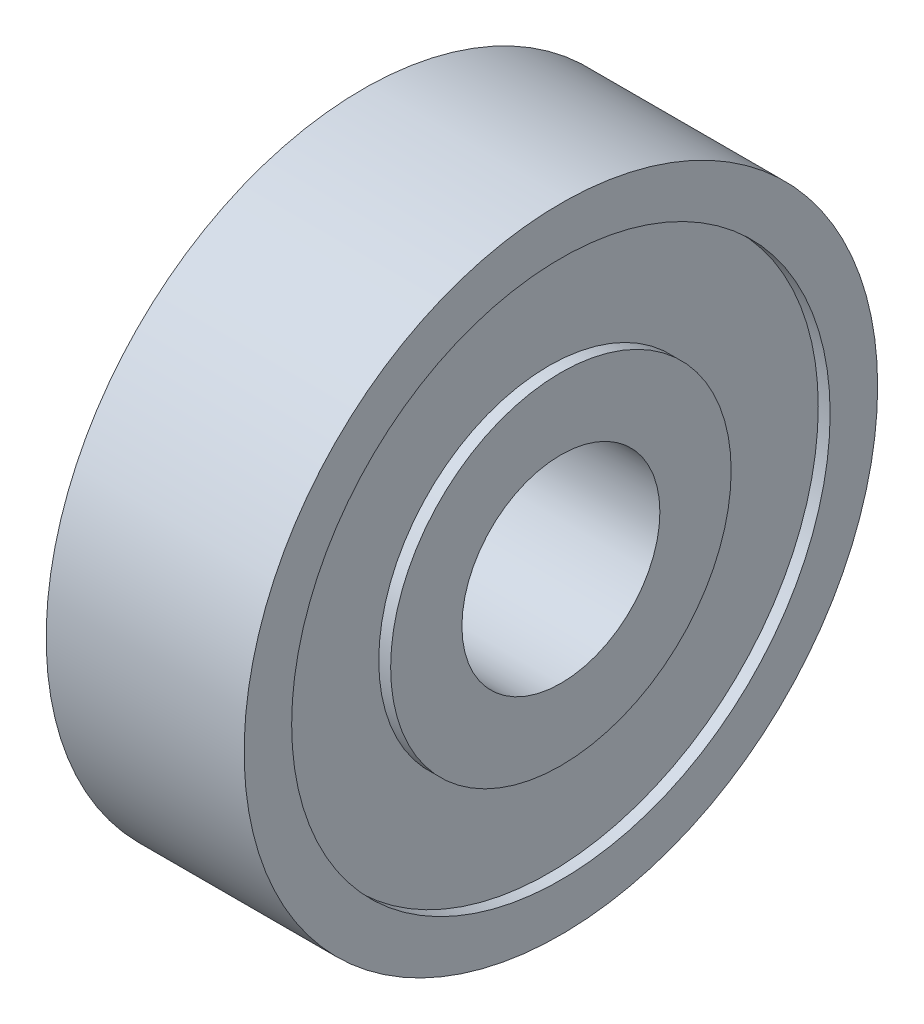
ISO-10303-21;
HEADER;
FILE_DESCRIPTION(('STEP AP214'),'2;1');
FILE_NAME('part.step','',(''),(''),'','','');
FILE_SCHEMA(('AUTOMOTIVE_DESIGN { 1 0 10303 214 1 1 1 1 }'));
ENDSEC;
DATA;
#1=APPLICATION_CONTEXT('core data for automotive mechanical design processes');
#2=APPLICATION_PROTOCOL_DEFINITION('international standard','automotive_design',2000,#1);
#3=PRODUCT_CONTEXT('',#1,'mechanical');
#4=PRODUCT('Part','Part','',(#3));
#5=PRODUCT_RELATED_PRODUCT_CATEGORY('part','',(#4));
#6=PRODUCT_DEFINITION_FORMATION('','',#4);
#7=PRODUCT_DEFINITION_CONTEXT('part definition',#1,'design');
#8=PRODUCT_DEFINITION('design','',#6,#7);
#9=PRODUCT_DEFINITION_SHAPE('','',#8);
#10=(LENGTH_UNIT() NAMED_UNIT(*) SI_UNIT(.MILLI.,.METRE.));
#11=(NAMED_UNIT(*) PLANE_ANGLE_UNIT() SI_UNIT($,.RADIAN.));
#12=(NAMED_UNIT(*) SI_UNIT($,.STERADIAN.) SOLID_ANGLE_UNIT());
#13=UNCERTAINTY_MEASURE_WITH_UNIT(LENGTH_MEASURE(1.E-05),#10,'distance_accuracy_value','');
#14=(GEOMETRIC_REPRESENTATION_CONTEXT(3) GLOBAL_UNCERTAINTY_ASSIGNED_CONTEXT((#13)) GLOBAL_UNIT_ASSIGNED_CONTEXT((#10,
#11,#12)) REPRESENTATION_CONTEXT('',''));
#15=CARTESIAN_POINT('',(0.,0.,0.));
#16=DIRECTION('',(0.,0.,1.));
#17=DIRECTION('',(1.,0.,0.));
#18=AXIS2_PLACEMENT_3D('',#15,#16,#17);
#19=CARTESIAN_POINT('',(-2.5,2.5,0.));
#20=DIRECTION('',(-1.,0.,0.));
#21=DIRECTION('',(0.,0.,1.));
#22=AXIS2_PLACEMENT_3D('',#19,#20,#21);
#23=PLANE('',#22);
#24=CARTESIAN_POINT('',(-2.5,0.,0.));
#25=DIRECTION('',(1.,0.,0.));
#26=DIRECTION('',(0.,0.,-1.));
#27=AXIS2_PLACEMENT_3D('',#24,#25,#26);
#28=CIRCLE('',#27,2.5);
#29=CARTESIAN_POINT('',(-2.5,0.,-2.5));
#30=VERTEX_POINT('',#29);
#31=EDGE_CURVE('E76',#30,#30,#28,.T.);
#32=ORIENTED_EDGE('',*,*,#31,.T.);
#33=EDGE_LOOP('',(#32));
#34=FACE_BOUND('',#33,.T.);
#35=CARTESIAN_POINT('',(-2.5,0.,0.));
#36=DIRECTION('',(1.,0.,0.));
#37=DIRECTION('',(0.,0.,-1.));
#38=AXIS2_PLACEMENT_3D('',#35,#36,#37);
#39=CIRCLE('',#38,4.3);
#40=CARTESIAN_POINT('',(-2.5,0.,-4.3));
#41=VERTEX_POINT('',#40);
#42=EDGE_CURVE('E10',#41,#41,#39,.T.);
#43=ORIENTED_EDGE('',*,*,#42,.F.);
#44=EDGE_LOOP('',(#43));
#45=FACE_BOUND('',#44,.T.);
#46=ADVANCED_FACE('F36',(#34,#45),#23,.T.);
#47=CARTESIAN_POINT('',(0.,0.,0.));
#48=DIRECTION('',(1.,0.,0.));
#49=DIRECTION('',(0.,0.,-1.));
#50=AXIS2_PLACEMENT_3D('',#47,#48,#49);
#51=CYLINDRICAL_SURFACE('',#50,4.3);
#52=ORIENTED_EDGE('',*,*,#42,.T.);
#53=EDGE_LOOP('',(#52));
#54=FACE_BOUND('',#53,.T.);
#55=CARTESIAN_POINT('',(-2.2,0.,0.));
#56=DIRECTION('',(1.,0.,0.));
#57=DIRECTION('',(0.,0.,-1.));
#58=AXIS2_PLACEMENT_3D('',#55,#56,#57);
#59=CIRCLE('',#58,4.3);
#60=CARTESIAN_POINT('',(-2.2,0.,-4.3));
#61=VERTEX_POINT('',#60);
#62=EDGE_CURVE('E42',#61,#61,#59,.T.);
#63=ORIENTED_EDGE('',*,*,#62,.F.);
#64=EDGE_LOOP('',(#63));
#65=FACE_BOUND('',#64,.T.);
#66=ADVANCED_FACE('F94',(#54,#65),#51,.T.);
#67=CARTESIAN_POINT('',(-2.2,4.3,0.));
#68=DIRECTION('',(-1.,0.,0.));
#69=DIRECTION('',(0.,0.,1.));
#70=AXIS2_PLACEMENT_3D('',#67,#68,#69);
#71=PLANE('',#70);
#72=ORIENTED_EDGE('',*,*,#62,.T.);
#73=EDGE_LOOP('',(#72));
#74=FACE_BOUND('',#73,.T.);
#75=CARTESIAN_POINT('',(-2.2,0.,0.));
#76=DIRECTION('',(1.,0.,0.));
#77=DIRECTION('',(0.,0.,-1.));
#78=AXIS2_PLACEMENT_3D('',#75,#76,#77);
#79=CIRCLE('',#78,6.8);
#80=CARTESIAN_POINT('',(-2.2,0.,-6.8));
#81=VERTEX_POINT('',#80);
#82=EDGE_CURVE('E46',#81,#81,#79,.T.);
#83=ORIENTED_EDGE('',*,*,#82,.F.);
#84=EDGE_LOOP('',(#83));
#85=FACE_BOUND('',#84,.T.);
#86=ADVANCED_FACE('F98',(#74,#85),#71,.T.);
#87=CARTESIAN_POINT('',(0.,0.,0.));
#88=DIRECTION('',(1.,0.,0.));
#89=DIRECTION('',(0.,0.,-1.));
#90=AXIS2_PLACEMENT_3D('',#87,#88,#89);
#91=CYLINDRICAL_SURFACE('',#90,6.8);
#92=ORIENTED_EDGE('',*,*,#82,.T.);
#93=EDGE_LOOP('',(#92));
#94=FACE_BOUND('',#93,.T.);
#95=CARTESIAN_POINT('',(-2.5,0.,0.));
#96=DIRECTION('',(1.,0.,0.));
#97=DIRECTION('',(0.,0.,-1.));
#98=AXIS2_PLACEMENT_3D('',#95,#96,#97);
#99=CIRCLE('',#98,6.8);
#100=CARTESIAN_POINT('',(-2.5,0.,-6.8));
#101=VERTEX_POINT('',#100);
#102=EDGE_CURVE('E50',#101,#101,#99,.T.);
#103=ORIENTED_EDGE('',*,*,#102,.F.);
#104=EDGE_LOOP('',(#103));
#105=FACE_BOUND('',#104,.T.);
#106=ADVANCED_FACE('F102',(#94,#105),#91,.F.);
#107=CARTESIAN_POINT('',(-2.5,6.8,0.));
#108=DIRECTION('',(-1.,0.,0.));
#109=DIRECTION('',(0.,0.,1.));
#110=AXIS2_PLACEMENT_3D('',#107,#108,#109);
#111=PLANE('',#110);
#112=ORIENTED_EDGE('',*,*,#102,.T.);
#113=EDGE_LOOP('',(#112));
#114=FACE_BOUND('',#113,.T.);
#115=CARTESIAN_POINT('',(-2.5,0.,0.));
#116=DIRECTION('',(1.,0.,0.));
#117=DIRECTION('',(0.,0.,-1.));
#118=AXIS2_PLACEMENT_3D('',#115,#116,#117);
#119=CIRCLE('',#118,8.);
#120=CARTESIAN_POINT('',(-2.5,0.,-8.));
#121=VERTEX_POINT('',#120);
#122=EDGE_CURVE('E55',#121,#121,#119,.T.);
#123=ORIENTED_EDGE('',*,*,#122,.F.);
#124=EDGE_LOOP('',(#123));
#125=FACE_BOUND('',#124,.T.);
#126=ADVANCED_FACE('F108',(#114,#125),#111,.T.);
#127=CARTESIAN_POINT('',(0.,0.,0.));
#128=DIRECTION('',(1.,0.,0.));
#129=DIRECTION('',(0.,0.,-1.));
#130=AXIS2_PLACEMENT_3D('',#127,#128,#129);
#131=CYLINDRICAL_SURFACE('',#130,8.);
#132=ORIENTED_EDGE('',*,*,#122,.T.);
#133=EDGE_LOOP('',(#132));
#134=FACE_BOUND('',#133,.T.);
#135=CARTESIAN_POINT('',(2.5,0.,0.));
#136=DIRECTION('',(1.,0.,0.));
#137=DIRECTION('',(0.,0.,-1.));
#138=AXIS2_PLACEMENT_3D('',#135,#136,#137);
#139=CIRCLE('',#138,8.);
#140=CARTESIAN_POINT('',(2.5,0.,-8.));
#141=VERTEX_POINT('',#140);
#142=EDGE_CURVE('E58',#141,#141,#139,.T.);
#143=ORIENTED_EDGE('',*,*,#142,.F.);
#144=EDGE_LOOP('',(#143));
#145=FACE_BOUND('',#144,.T.);
#146=ADVANCED_FACE('F112',(#134,#145),#131,.T.);
#147=CARTESIAN_POINT('',(2.5,6.8,0.));
#148=DIRECTION('',(1.,0.,0.));
#149=DIRECTION('',(0.,0.,-1.));
#150=AXIS2_PLACEMENT_3D('',#147,#148,#149);
#151=PLANE('',#150);
#152=ORIENTED_EDGE('',*,*,#142,.T.);
#153=EDGE_LOOP('',(#152));
#154=FACE_BOUND('',#153,.T.);
#155=CARTESIAN_POINT('',(2.5,0.,0.));
#156=DIRECTION('',(1.,0.,0.));
#157=DIRECTION('',(0.,0.,-1.));
#158=AXIS2_PLACEMENT_3D('',#155,#156,#157);
#159=CIRCLE('',#158,6.8);
#160=CARTESIAN_POINT('',(2.5,0.,-6.8));
#161=VERTEX_POINT('',#160);
#162=EDGE_CURVE('E61',#161,#161,#159,.T.);
#163=ORIENTED_EDGE('',*,*,#162,.F.);
#164=EDGE_LOOP('',(#163));
#165=FACE_BOUND('',#164,.T.);
#166=ADVANCED_FACE('F116',(#154,#165),#151,.T.);
#167=CARTESIAN_POINT('',(0.,0.,0.));
#168=DIRECTION('',(1.,0.,0.));
#169=DIRECTION('',(0.,0.,-1.));
#170=AXIS2_PLACEMENT_3D('',#167,#168,#169);
#171=CYLINDRICAL_SURFACE('',#170,6.8);
#172=ORIENTED_EDGE('',*,*,#162,.T.);
#173=EDGE_LOOP('',(#172));
#174=FACE_BOUND('',#173,.T.);
#175=CARTESIAN_POINT('',(2.2,0.,0.));
#176=DIRECTION('',(1.,0.,0.));
#177=DIRECTION('',(0.,0.,-1.));
#178=AXIS2_PLACEMENT_3D('',#175,#176,#177);
#179=CIRCLE('',#178,6.8);
#180=CARTESIAN_POINT('',(2.2,0.,-6.8));
#181=VERTEX_POINT('',#180);
#182=EDGE_CURVE('E64',#181,#181,#179,.T.);
#183=ORIENTED_EDGE('',*,*,#182,.F.);
#184=EDGE_LOOP('',(#183));
#185=FACE_BOUND('',#184,.T.);
#186=ADVANCED_FACE('F120',(#174,#185),#171,.F.);
#187=CARTESIAN_POINT('',(2.2,4.3,0.));
#188=DIRECTION('',(1.,0.,0.));
#189=DIRECTION('',(0.,0.,-1.));
#190=AXIS2_PLACEMENT_3D('',#187,#188,#189);
#191=PLANE('',#190);
#192=ORIENTED_EDGE('',*,*,#182,.T.);
#193=EDGE_LOOP('',(#192));
#194=FACE_BOUND('',#193,.T.);
#195=CARTESIAN_POINT('',(2.2,0.,0.));
#196=DIRECTION('',(1.,0.,0.));
#197=DIRECTION('',(0.,0.,-1.));
#198=AXIS2_PLACEMENT_3D('',#195,#196,#197);
#199=CIRCLE('',#198,4.3);
#200=CARTESIAN_POINT('',(2.2,0.,-4.3));
#201=VERTEX_POINT('',#200);
#202=EDGE_CURVE('E67',#201,#201,#199,.T.);
#203=ORIENTED_EDGE('',*,*,#202,.F.);
#204=EDGE_LOOP('',(#203));
#205=FACE_BOUND('',#204,.T.);
#206=ADVANCED_FACE('F124',(#194,#205),#191,.T.);
#207=CARTESIAN_POINT('',(0.,0.,0.));
#208=DIRECTION('',(1.,0.,0.));
#209=DIRECTION('',(0.,0.,-1.));
#210=AXIS2_PLACEMENT_3D('',#207,#208,#209);
#211=CYLINDRICAL_SURFACE('',#210,4.3);
#212=ORIENTED_EDGE('',*,*,#202,.T.);
#213=EDGE_LOOP('',(#212));
#214=FACE_BOUND('',#213,.T.);
#215=CARTESIAN_POINT('',(2.5,0.,0.));
#216=DIRECTION('',(1.,0.,0.));
#217=DIRECTION('',(0.,0.,-1.));
#218=AXIS2_PLACEMENT_3D('',#215,#216,#217);
#219=CIRCLE('',#218,4.3);
#220=CARTESIAN_POINT('',(2.5,0.,-4.3));
#221=VERTEX_POINT('',#220);
#222=EDGE_CURVE('E70',#221,#221,#219,.T.);
#223=ORIENTED_EDGE('',*,*,#222,.F.);
#224=EDGE_LOOP('',(#223));
#225=FACE_BOUND('',#224,.T.);
#226=ADVANCED_FACE('F90',(#214,#225),#211,.T.);
#227=CARTESIAN_POINT('',(2.5,2.5,0.));
#228=DIRECTION('',(1.,0.,0.));
#229=DIRECTION('',(0.,0.,-1.));
#230=AXIS2_PLACEMENT_3D('',#227,#228,#229);
#231=PLANE('',#230);
#232=ORIENTED_EDGE('',*,*,#222,.T.);
#233=EDGE_LOOP('',(#232));
#234=FACE_BOUND('',#233,.T.);
#235=CARTESIAN_POINT('',(2.5,0.,0.));
#236=DIRECTION('',(1.,0.,0.));
#237=DIRECTION('',(0.,0.,-1.));
#238=AXIS2_PLACEMENT_3D('',#235,#236,#237);
#239=CIRCLE('',#238,2.5);
#240=CARTESIAN_POINT('',(2.5,0.,-2.5));
#241=VERTEX_POINT('',#240);
#242=EDGE_CURVE('E73',#241,#241,#239,.T.);
#243=ORIENTED_EDGE('',*,*,#242,.F.);
#244=EDGE_LOOP('',(#243));
#245=FACE_BOUND('',#244,.T.);
#246=ADVANCED_FACE('F84',(#234,#245),#231,.T.);
#247=CARTESIAN_POINT('',(0.,0.,0.));
#248=DIRECTION('',(1.,0.,0.));
#249=DIRECTION('',(0.,0.,-1.));
#250=AXIS2_PLACEMENT_3D('',#247,#248,#249);
#251=CYLINDRICAL_SURFACE('',#250,2.5);
#252=ORIENTED_EDGE('',*,*,#242,.T.);
#253=EDGE_LOOP('',(#252));
#254=FACE_BOUND('',#253,.T.);
#255=ORIENTED_EDGE('',*,*,#31,.F.);
#256=EDGE_LOOP('',(#255));
#257=FACE_BOUND('',#256,.T.);
#258=ADVANCED_FACE('F82',(#254,#257),#251,.F.);
#259=CLOSED_SHELL('',(#46,#66,#86,#106,#126,#146,#166,#186,#206,#226,#246,#258));
#260=MANIFOLD_SOLID_BREP('B2',#259);
#261=ADVANCED_BREP_SHAPE_REPRESENTATION('',(#18,#260),#14);
#262=SHAPE_DEFINITION_REPRESENTATION(#9,#261);
ENDSEC;
END-ISO-10303-21;
